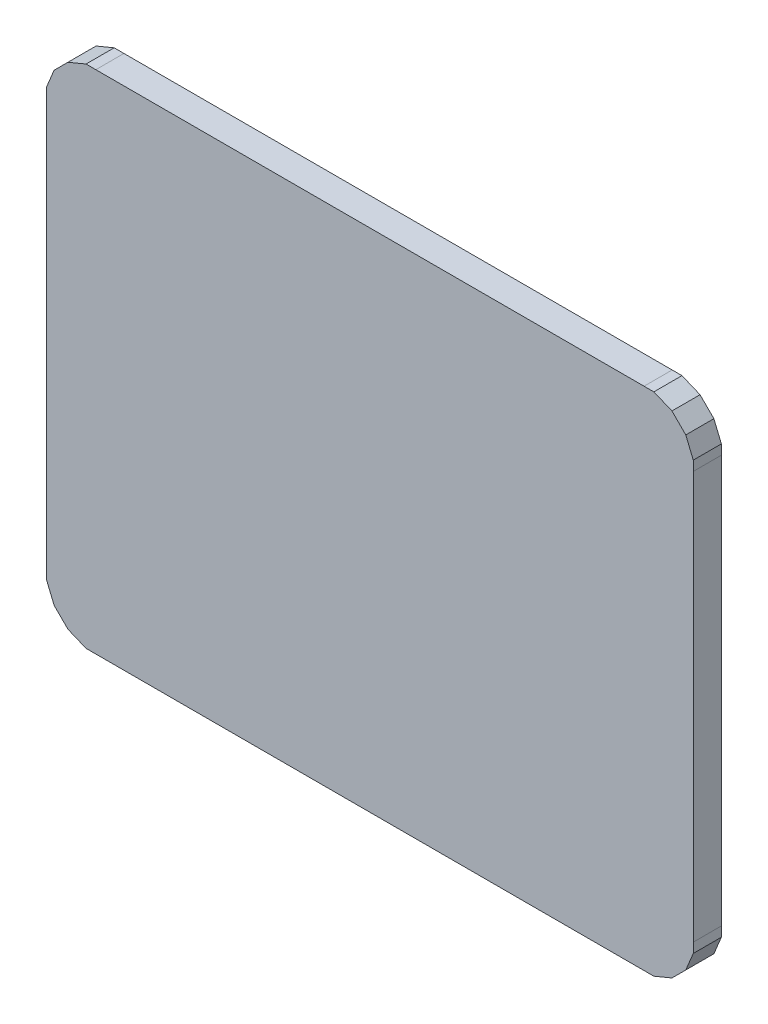
ISO-10303-21;
HEADER;
FILE_DESCRIPTION(('STEP AP214'),'2;1');
FILE_NAME('part.step','',(''),(''),'','','');
FILE_SCHEMA(('AUTOMOTIVE_DESIGN { 1 0 10303 214 1 1 1 1 }'));
ENDSEC;
DATA;
#1=APPLICATION_CONTEXT('core data for automotive mechanical design processes');
#2=APPLICATION_PROTOCOL_DEFINITION('international standard','automotive_design',2000,#1);
#3=PRODUCT_CONTEXT('',#1,'mechanical');
#4=PRODUCT('Part','Part','',(#3));
#5=PRODUCT_RELATED_PRODUCT_CATEGORY('part','',(#4));
#6=PRODUCT_DEFINITION_FORMATION('','',#4);
#7=PRODUCT_DEFINITION_CONTEXT('part definition',#1,'design');
#8=PRODUCT_DEFINITION('design','',#6,#7);
#9=PRODUCT_DEFINITION_SHAPE('','',#8);
#10=(LENGTH_UNIT() NAMED_UNIT(*) SI_UNIT(.MILLI.,.METRE.));
#11=(NAMED_UNIT(*) PLANE_ANGLE_UNIT() SI_UNIT($,.RADIAN.));
#12=(NAMED_UNIT(*) SI_UNIT($,.STERADIAN.) SOLID_ANGLE_UNIT());
#13=UNCERTAINTY_MEASURE_WITH_UNIT(LENGTH_MEASURE(1.E-05),#10,'distance_accuracy_value','');
#14=(GEOMETRIC_REPRESENTATION_CONTEXT(3) GLOBAL_UNCERTAINTY_ASSIGNED_CONTEXT((#13)) GLOBAL_UNIT_ASSIGNED_CONTEXT((#10,
#11,#12)) REPRESENTATION_CONTEXT('',''));
#15=CARTESIAN_POINT('',(0.,0.,0.));
#16=DIRECTION('',(0.,0.,1.));
#17=DIRECTION('',(1.,0.,0.));
#18=AXIS2_PLACEMENT_3D('',#15,#16,#17);
#19=CARTESIAN_POINT('',(-0.97499932,0.90000074,0.0999998));
#20=DIRECTION('',(0.,0.,-1.));
#21=DIRECTION('',(0.,-1.,0.));
#22=AXIS2_PLACEMENT_3D('',#19,#20,#21);
#23=PLANE('',#22);
#24=DIRECTION('',(-1.,0.,0.));
#25=VECTOR('',#24,1.);
#26=CARTESIAN_POINT('',(-0.97499932,0.90000074,0.0999998));
#27=LINE('',#26,#25);
#28=CARTESIAN_POINT('',(-0.97499932,0.90000074,0.0999998));
#29=VERTEX_POINT('',#28);
#30=CARTESIAN_POINT('',(-1.00981002,0.90000074,0.0999998));
#31=VERTEX_POINT('',#30);
#32=EDGE_CURVE('E242',#29,#31,#27,.T.);
#33=ORIENTED_EDGE('',*,*,#32,.T.);
#34=DIRECTION('',(-0.923868310657664,-0.382710523192861,0.));
#35=VECTOR('',#34,1.);
#36=CARTESIAN_POINT('',(-1.00981002,0.90000074,0.0999998));
#37=LINE('',#36,#35);
#38=CARTESIAN_POINT('',(-1.07413044,0.87335614,0.0999998));
#39=VERTEX_POINT('',#38);
#40=EDGE_CURVE('E284',#31,#39,#37,.T.);
#41=ORIENTED_EDGE('',*,*,#40,.T.);
#42=DIRECTION('',(-0.707106781186548,-0.707106781186548,0.));
#43=VECTOR('',#42,1.);
#44=CARTESIAN_POINT('',(-1.07413044,0.87335614,0.0999998));
#45=LINE('',#44,#43);
#46=CARTESIAN_POINT('',(-1.12335818,0.8241284,0.0999998));
#47=VERTEX_POINT('',#46);
#48=EDGE_CURVE('E303',#39,#47,#45,.T.);
#49=ORIENTED_EDGE('',*,*,#48,.T.);
#50=DIRECTION('',(-0.382679382796116,-0.92388120988728,0.));
#51=VECTOR('',#50,1.);
#52=CARTESIAN_POINT('',(-1.12335818,0.8241284,0.0999998));
#53=LINE('',#52,#51);
#54=CARTESIAN_POINT('',(-1.15000024,0.75980798,0.0999998));
#55=VERTEX_POINT('',#54);
#56=EDGE_CURVE('E270',#47,#55,#53,.T.);
#57=ORIENTED_EDGE('',*,*,#56,.T.);
#58=DIRECTION('',(0.,-1.,0.));
#59=VECTOR('',#58,1.);
#60=CARTESIAN_POINT('',(-1.15000024,0.75980798,0.0999998));
#61=LINE('',#60,#59);
#62=CARTESIAN_POINT('',(-1.15000024,0.72499982,0.0999998));
#63=VERTEX_POINT('',#62);
#64=EDGE_CURVE('E336',#55,#63,#61,.T.);
#65=ORIENTED_EDGE('',*,*,#64,.T.);
#66=DIRECTION('',(0.,-1.,0.));
#67=VECTOR('',#66,1.);
#68=CARTESIAN_POINT('',(-1.15000024,0.72499982,0.0999998));
#69=LINE('',#68,#67);
#70=CARTESIAN_POINT('',(-1.15000024,-0.72499982,0.0999998));
#71=VERTEX_POINT('',#70);
#72=EDGE_CURVE('E383',#63,#71,#69,.T.);
#73=ORIENTED_EDGE('',*,*,#72,.T.);
#74=DIRECTION('',(0.,-1.,0.));
#75=VECTOR('',#74,1.);
#76=CARTESIAN_POINT('',(-1.15000024,-0.72499982,0.0999998));
#77=LINE('',#76,#75);
#78=CARTESIAN_POINT('',(-1.15000024,-0.75981052,0.0999998));
#79=VERTEX_POINT('',#78);
#80=EDGE_CURVE('E405',#71,#79,#77,.T.);
#81=ORIENTED_EDGE('',*,*,#80,.T.);
#82=DIRECTION('',(0.382679382796116,-0.92388120988728,0.));
#83=VECTOR('',#82,1.);
#84=CARTESIAN_POINT('',(-1.15000024,-0.75981052,0.0999998));
#85=LINE('',#84,#83);
#86=CARTESIAN_POINT('',(-1.12335818,-0.82413094,0.0999998));
#87=VERTEX_POINT('',#86);
#88=EDGE_CURVE('E271',#79,#87,#85,.T.);
#89=ORIENTED_EDGE('',*,*,#88,.T.);
#90=DIRECTION('',(0.707106781186548,-0.707106781186548,0.));
#91=VECTOR('',#90,1.);
#92=CARTESIAN_POINT('',(-1.12335818,-0.82413094,0.0999998));
#93=LINE('',#92,#91);
#94=CARTESIAN_POINT('',(-1.07413044,-0.87335868,0.0999998));
#95=VERTEX_POINT('',#94);
#96=EDGE_CURVE('E352',#87,#95,#93,.T.);
#97=ORIENTED_EDGE('',*,*,#96,.T.);
#98=DIRECTION('',(0.92388120988728,-0.382679382796116,0.));
#99=VECTOR('',#98,1.);
#100=CARTESIAN_POINT('',(-1.07413044,-0.87335868,0.0999998));
#101=LINE('',#100,#99);
#102=CARTESIAN_POINT('',(-1.00981002,-0.90000074,0.0999998));
#103=VERTEX_POINT('',#102);
#104=EDGE_CURVE('E430',#95,#103,#101,.T.);
#105=ORIENTED_EDGE('',*,*,#104,.T.);
#106=DIRECTION('',(1.,0.,0.));
#107=VECTOR('',#106,1.);
#108=CARTESIAN_POINT('',(-1.00981002,-0.90000074,0.0999998));
#109=LINE('',#108,#107);
#110=CARTESIAN_POINT('',(-0.97499932,-0.90000074,0.0999998));
#111=VERTEX_POINT('',#110);
#112=EDGE_CURVE('E370',#103,#111,#109,.T.);
#113=ORIENTED_EDGE('',*,*,#112,.T.);
#114=DIRECTION('',(1.,0.,0.));
#115=VECTOR('',#114,1.);
#116=CARTESIAN_POINT('',(-0.97499932,-0.90000074,0.0999998));
#117=LINE('',#116,#115);
#118=CARTESIAN_POINT('',(0.97499932,-0.90000074,0.0999998));
#119=VERTEX_POINT('',#118);
#120=EDGE_CURVE('E435',#111,#119,#117,.T.);
#121=ORIENTED_EDGE('',*,*,#120,.T.);
#122=DIRECTION('',(1.,0.,0.));
#123=VECTOR('',#122,1.);
#124=CARTESIAN_POINT('',(0.97499932,-0.90000074,0.0999998));
#125=LINE('',#124,#123);
#126=CARTESIAN_POINT('',(1.00980748,-0.90000074,0.0999998));
#127=VERTEX_POINT('',#126);
#128=EDGE_CURVE('E297',#119,#127,#125,.T.);
#129=ORIENTED_EDGE('',*,*,#128,.T.);
#130=DIRECTION('',(0.92388120988728,0.382679382796116,0.));
#131=VECTOR('',#130,1.);
#132=CARTESIAN_POINT('',(1.00980748,-0.90000074,0.0999998));
#133=LINE('',#132,#131);
#134=CARTESIAN_POINT('',(1.0741279,-0.87335868,0.0999998));
#135=VERTEX_POINT('',#134);
#136=EDGE_CURVE('E464',#127,#135,#133,.T.);
#137=ORIENTED_EDGE('',*,*,#136,.T.);
#138=DIRECTION('',(0.707106781186548,0.707106781186548,0.));
#139=VECTOR('',#138,1.);
#140=CARTESIAN_POINT('',(1.0741279,-0.87335868,0.0999998));
#141=LINE('',#140,#139);
#142=CARTESIAN_POINT('',(1.12335564,-0.82413094,0.0999998));
#143=VERTEX_POINT('',#142);
#144=EDGE_CURVE('E479',#135,#143,#141,.T.);
#145=ORIENTED_EDGE('',*,*,#144,.T.);
#146=DIRECTION('',(0.382710523192008,0.923868310658018,0.));
#147=VECTOR('',#146,1.);
#148=CARTESIAN_POINT('',(1.12335564,-0.82413094,0.0999998));
#149=LINE('',#148,#147);
#150=CARTESIAN_POINT('',(1.15000024,-0.75981052,0.0999998));
#151=VERTEX_POINT('',#150);
#152=EDGE_CURVE('E322',#143,#151,#149,.T.);
#153=ORIENTED_EDGE('',*,*,#152,.T.);
#154=DIRECTION('',(0.,1.,0.));
#155=VECTOR('',#154,1.);
#156=CARTESIAN_POINT('',(1.15000024,-0.75981052,0.0999998));
#157=LINE('',#156,#155);
#158=CARTESIAN_POINT('',(1.15000024,-0.72499982,0.0999998));
#159=VERTEX_POINT('',#158);
#160=EDGE_CURVE('E364',#151,#159,#157,.T.);
#161=ORIENTED_EDGE('',*,*,#160,.T.);
#162=DIRECTION('',(0.,1.,0.));
#163=VECTOR('',#162,1.);
#164=CARTESIAN_POINT('',(1.15000024,-0.72499982,0.0999998));
#165=LINE('',#164,#163);
#166=CARTESIAN_POINT('',(1.15000024,0.72499982,0.0999998));
#167=VERTEX_POINT('',#166);
#168=EDGE_CURVE('E389',#159,#167,#165,.T.);
#169=ORIENTED_EDGE('',*,*,#168,.T.);
#170=DIRECTION('',(0.,1.,0.));
#171=VECTOR('',#170,1.);
#172=CARTESIAN_POINT('',(1.15000024,0.72499982,0.0999998));
#173=LINE('',#172,#171);
#174=CARTESIAN_POINT('',(1.15000024,0.75980798,0.0999998));
#175=VERTEX_POINT('',#174);
#176=EDGE_CURVE('E332',#167,#175,#173,.T.);
#177=ORIENTED_EDGE('',*,*,#176,.T.);
#178=DIRECTION('',(-0.382710523191154,0.923868310658371,0.));
#179=VECTOR('',#178,1.);
#180=CARTESIAN_POINT('',(1.15000024,0.75980798,0.0999998));
#181=LINE('',#180,#179);
#182=CARTESIAN_POINT('',(1.12335564,0.8241284,0.0999998));
#183=VERTEX_POINT('',#182);
#184=EDGE_CURVE('E340',#175,#183,#181,.T.);
#185=ORIENTED_EDGE('',*,*,#184,.T.);
#186=DIRECTION('',(-0.707106781186548,0.707106781186548,0.));
#187=VECTOR('',#186,1.);
#188=CARTESIAN_POINT('',(1.12335564,0.8241284,0.0999998));
#189=LINE('',#188,#187);
#190=CARTESIAN_POINT('',(1.0741279,0.87335614,0.0999998));
#191=VERTEX_POINT('',#190);
#192=EDGE_CURVE('E259',#183,#191,#189,.T.);
#193=ORIENTED_EDGE('',*,*,#192,.T.);
#194=DIRECTION('',(-0.923868310657664,0.382710523192861,0.));
#195=VECTOR('',#194,1.);
#196=CARTESIAN_POINT('',(1.0741279,0.87335614,0.0999998));
#197=LINE('',#196,#195);
#198=CARTESIAN_POINT('',(1.00980748,0.90000074,0.0999998));
#199=VERTEX_POINT('',#198);
#200=EDGE_CURVE('E288',#191,#199,#197,.T.);
#201=ORIENTED_EDGE('',*,*,#200,.T.);
#202=DIRECTION('',(-1.,0.,0.));
#203=VECTOR('',#202,1.);
#204=CARTESIAN_POINT('',(1.00980748,0.90000074,0.0999998));
#205=LINE('',#204,#203);
#206=CARTESIAN_POINT('',(0.97499932,0.90000074,0.0999998));
#207=VERTEX_POINT('',#206);
#208=EDGE_CURVE('E235',#199,#207,#205,.T.);
#209=ORIENTED_EDGE('',*,*,#208,.T.);
#210=DIRECTION('',(-1.,0.,0.));
#211=VECTOR('',#210,1.);
#212=CARTESIAN_POINT('',(0.97499932,0.90000074,0.0999998));
#213=LINE('',#212,#211);
#214=EDGE_CURVE('E11',#207,#29,#213,.T.);
#215=ORIENTED_EDGE('',*,*,#214,.T.);
#216=EDGE_LOOP('',(#33,#41,#49,#57,#65,#73,#81,#89,#97,#105,#113,#121,#129,#137,#145,#153,#161,
#169,#177,#185,#193,#201,#209,#215));
#217=FACE_BOUND('',#216,.T.);
#218=ADVANCED_FACE('F17',(#217),#23,.F.);
#219=CARTESIAN_POINT('',(-0.97499932,0.90000074,0.));
#220=DIRECTION('',(0.,0.,-1.));
#221=DIRECTION('',(0.,-1.,0.));
#222=AXIS2_PLACEMENT_3D('',#219,#220,#221);
#223=PLANE('',#222);
#224=DIRECTION('',(-1.,0.,0.));
#225=VECTOR('',#224,1.);
#226=CARTESIAN_POINT('',(0.97499932,0.90000074,0.));
#227=LINE('',#226,#225);
#228=CARTESIAN_POINT('',(0.97499932,0.90000074,0.));
#229=VERTEX_POINT('',#228);
#230=CARTESIAN_POINT('',(-0.97499932,0.90000074,0.));
#231=VERTEX_POINT('',#230);
#232=EDGE_CURVE('E26',#229,#231,#227,.T.);
#233=ORIENTED_EDGE('',*,*,#232,.F.);
#234=DIRECTION('',(-1.,0.,0.));
#235=VECTOR('',#234,1.);
#236=CARTESIAN_POINT('',(1.00980748,0.90000074,0.));
#237=LINE('',#236,#235);
#238=CARTESIAN_POINT('',(1.00980748,0.90000074,0.));
#239=VERTEX_POINT('',#238);
#240=EDGE_CURVE('E292',#239,#229,#237,.T.);
#241=ORIENTED_EDGE('',*,*,#240,.F.);
#242=DIRECTION('',(-0.923868310657664,0.382710523192861,0.));
#243=VECTOR('',#242,1.);
#244=CARTESIAN_POINT('',(1.0741279,0.87335614,0.));
#245=LINE('',#244,#243);
#246=CARTESIAN_POINT('',(1.0741279,0.87335614,0.));
#247=VERTEX_POINT('',#246);
#248=EDGE_CURVE('E262',#247,#239,#245,.T.);
#249=ORIENTED_EDGE('',*,*,#248,.F.);
#250=DIRECTION('',(-0.707106781186548,0.707106781186548,0.));
#251=VECTOR('',#250,1.);
#252=CARTESIAN_POINT('',(1.12335564,0.8241284,0.));
#253=LINE('',#252,#251);
#254=CARTESIAN_POINT('',(1.12335564,0.8241284,0.));
#255=VERTEX_POINT('',#254);
#256=EDGE_CURVE('E397',#255,#247,#253,.T.);
#257=ORIENTED_EDGE('',*,*,#256,.F.);
#258=DIRECTION('',(-0.382710523191154,0.923868310658371,0.));
#259=VECTOR('',#258,1.);
#260=CARTESIAN_POINT('',(1.15000024,0.75980798,0.));
#261=LINE('',#260,#259);
#262=CARTESIAN_POINT('',(1.15000024,0.75980798,0.));
#263=VERTEX_POINT('',#262);
#264=EDGE_CURVE('E327',#263,#255,#261,.T.);
#265=ORIENTED_EDGE('',*,*,#264,.F.);
#266=DIRECTION('',(0.,1.,0.));
#267=VECTOR('',#266,1.);
#268=CARTESIAN_POINT('',(1.15000024,0.72499982,0.));
#269=LINE('',#268,#267);
#270=CARTESIAN_POINT('',(1.15000024,0.72499982,0.));
#271=VERTEX_POINT('',#270);
#272=EDGE_CURVE('E384',#271,#263,#269,.T.);
#273=ORIENTED_EDGE('',*,*,#272,.F.);
#274=DIRECTION('',(0.,1.,0.));
#275=VECTOR('',#274,1.);
#276=CARTESIAN_POINT('',(1.15000024,-0.72499982,0.));
#277=LINE('',#276,#275);
#278=CARTESIAN_POINT('',(1.15000024,-0.72499982,0.));
#279=VERTEX_POINT('',#278);
#280=EDGE_CURVE('E425',#279,#271,#277,.T.);
#281=ORIENTED_EDGE('',*,*,#280,.F.);
#282=DIRECTION('',(0.,1.,0.));
#283=VECTOR('',#282,1.);
#284=CARTESIAN_POINT('',(1.15000024,-0.75981052,0.));
#285=LINE('',#284,#283);
#286=CARTESIAN_POINT('',(1.15000024,-0.75981052,0.));
#287=VERTEX_POINT('',#286);
#288=EDGE_CURVE('E365',#287,#279,#285,.T.);
#289=ORIENTED_EDGE('',*,*,#288,.F.);
#290=DIRECTION('',(0.382710523192008,0.923868310658018,0.));
#291=VECTOR('',#290,1.);
#292=CARTESIAN_POINT('',(1.12335564,-0.82413094,0.));
#293=LINE('',#292,#291);
#294=CARTESIAN_POINT('',(1.12335564,-0.82413094,0.));
#295=VERTEX_POINT('',#294);
#296=EDGE_CURVE('E323',#295,#287,#293,.T.);
#297=ORIENTED_EDGE('',*,*,#296,.F.);
#298=DIRECTION('',(0.707106781186548,0.707106781186548,0.));
#299=VECTOR('',#298,1.);
#300=CARTESIAN_POINT('',(1.0741279,-0.87335868,0.));
#301=LINE('',#300,#299);
#302=CARTESIAN_POINT('',(1.0741279,-0.87335868,0.));
#303=VERTEX_POINT('',#302);
#304=EDGE_CURVE('E471',#303,#295,#301,.T.);
#305=ORIENTED_EDGE('',*,*,#304,.F.);
#306=DIRECTION('',(0.92388120988728,0.382679382796116,0.));
#307=VECTOR('',#306,1.);
#308=CARTESIAN_POINT('',(1.00980748,-0.90000074,0.));
#309=LINE('',#308,#307);
#310=CARTESIAN_POINT('',(1.00980748,-0.90000074,0.));
#311=VERTEX_POINT('',#310);
#312=EDGE_CURVE('E301',#311,#303,#309,.T.);
#313=ORIENTED_EDGE('',*,*,#312,.F.);
#314=DIRECTION('',(1.,0.,0.));
#315=VECTOR('',#314,1.);
#316=CARTESIAN_POINT('',(0.97499932,-0.90000074,0.));
#317=LINE('',#316,#315);
#318=CARTESIAN_POINT('',(0.97499932,-0.90000074,0.));
#319=VERTEX_POINT('',#318);
#320=EDGE_CURVE('E431',#319,#311,#317,.T.);
#321=ORIENTED_EDGE('',*,*,#320,.F.);
#322=DIRECTION('',(1.,0.,0.));
#323=VECTOR('',#322,1.);
#324=CARTESIAN_POINT('',(-0.97499932,-0.90000074,0.));
#325=LINE('',#324,#323);
#326=CARTESIAN_POINT('',(-0.97499932,-0.90000074,0.));
#327=VERTEX_POINT('',#326);
#328=EDGE_CURVE('E374',#327,#319,#325,.T.);
#329=ORIENTED_EDGE('',*,*,#328,.F.);
#330=DIRECTION('',(1.,0.,0.));
#331=VECTOR('',#330,1.);
#332=CARTESIAN_POINT('',(-1.00981002,-0.90000074,0.));
#333=LINE('',#332,#331);
#334=CARTESIAN_POINT('',(-1.00981002,-0.90000074,0.));
#335=VERTEX_POINT('',#334);
#336=EDGE_CURVE('E439',#335,#327,#333,.T.);
#337=ORIENTED_EDGE('',*,*,#336,.F.);
#338=DIRECTION('',(0.92388120988728,-0.382679382796116,0.));
#339=VECTOR('',#338,1.);
#340=CARTESIAN_POINT('',(-1.07413044,-0.87335868,0.));
#341=LINE('',#340,#339);
#342=CARTESIAN_POINT('',(-1.07413044,-0.87335868,0.));
#343=VERTEX_POINT('',#342);
#344=EDGE_CURVE('E258',#343,#335,#341,.T.);
#345=ORIENTED_EDGE('',*,*,#344,.F.);
#346=DIRECTION('',(0.707106781186548,-0.707106781186548,0.));
#347=VECTOR('',#346,1.);
#348=CARTESIAN_POINT('',(-1.12335818,-0.82413094,0.));
#349=LINE('',#348,#347);
#350=CARTESIAN_POINT('',(-1.12335818,-0.82413094,0.));
#351=VERTEX_POINT('',#350);
#352=EDGE_CURVE('E275',#351,#343,#349,.T.);
#353=ORIENTED_EDGE('',*,*,#352,.F.);
#354=DIRECTION('',(0.382679382796116,-0.92388120988728,0.));
#355=VECTOR('',#354,1.);
#356=CARTESIAN_POINT('',(-1.15000024,-0.75981052,0.));
#357=LINE('',#356,#355);
#358=CARTESIAN_POINT('',(-1.15000024,-0.75981052,0.));
#359=VERTEX_POINT('',#358);
#360=EDGE_CURVE('E314',#359,#351,#357,.T.);
#361=ORIENTED_EDGE('',*,*,#360,.F.);
#362=DIRECTION('',(0.,-1.,0.));
#363=VECTOR('',#362,1.);
#364=CARTESIAN_POINT('',(-1.15000024,-0.72499982,0.));
#365=LINE('',#364,#363);
#366=CARTESIAN_POINT('',(-1.15000024,-0.72499982,0.));
#367=VERTEX_POINT('',#366);
#368=EDGE_CURVE('E393',#367,#359,#365,.T.);
#369=ORIENTED_EDGE('',*,*,#368,.F.);
#370=DIRECTION('',(0.,-1.,0.));
#371=VECTOR('',#370,1.);
#372=CARTESIAN_POINT('',(-1.15000024,0.72499982,0.));
#373=LINE('',#372,#371);
#374=CARTESIAN_POINT('',(-1.15000024,0.72499982,0.));
#375=VERTEX_POINT('',#374);
#376=EDGE_CURVE('E359',#375,#367,#373,.T.);
#377=ORIENTED_EDGE('',*,*,#376,.F.);
#378=DIRECTION('',(0.,-1.,0.));
#379=VECTOR('',#378,1.);
#380=CARTESIAN_POINT('',(-1.15000024,0.75980798,0.));
#381=LINE('',#380,#379);
#382=CARTESIAN_POINT('',(-1.15000024,0.75980798,0.));
#383=VERTEX_POINT('',#382);
#384=EDGE_CURVE('E265',#383,#375,#381,.T.);
#385=ORIENTED_EDGE('',*,*,#384,.F.);
#386=DIRECTION('',(-0.382679382796116,-0.92388120988728,0.));
#387=VECTOR('',#386,1.);
#388=CARTESIAN_POINT('',(-1.12335818,0.8241284,0.));
#389=LINE('',#388,#387);
#390=CARTESIAN_POINT('',(-1.12335818,0.8241284,0.));
#391=VERTEX_POINT('',#390);
#392=EDGE_CURVE('E307',#391,#383,#389,.T.);
#393=ORIENTED_EDGE('',*,*,#392,.F.);
#394=DIRECTION('',(-0.707106781186548,-0.707106781186548,0.));
#395=VECTOR('',#394,1.);
#396=CARTESIAN_POINT('',(-1.07413044,0.87335614,0.));
#397=LINE('',#396,#395);
#398=CARTESIAN_POINT('',(-1.07413044,0.87335614,0.));
#399=VERTEX_POINT('',#398);
#400=EDGE_CURVE('E279',#399,#391,#397,.T.);
#401=ORIENTED_EDGE('',*,*,#400,.F.);
#402=DIRECTION('',(-0.923868310657664,-0.382710523192861,0.));
#403=VECTOR('',#402,1.);
#404=CARTESIAN_POINT('',(-1.00981002,0.90000074,0.));
#405=LINE('',#404,#403);
#406=CARTESIAN_POINT('',(-1.00981002,0.90000074,0.));
#407=VERTEX_POINT('',#406);
#408=EDGE_CURVE('E244',#407,#399,#405,.T.);
#409=ORIENTED_EDGE('',*,*,#408,.F.);
#410=DIRECTION('',(-1.,0.,0.));
#411=VECTOR('',#410,1.);
#412=CARTESIAN_POINT('',(-0.97499932,0.90000074,0.));
#413=LINE('',#412,#411);
#414=EDGE_CURVE('E240',#231,#407,#413,.T.);
#415=ORIENTED_EDGE('',*,*,#414,.F.);
#416=EDGE_LOOP('',(#233,#241,#249,#257,#265,#273,#281,#289,#297,#305,#313,#321,#329,#337,#345,
#353,#361,#369,#377,#385,#393,#401,#409,#415));
#417=FACE_BOUND('',#416,.T.);
#418=ADVANCED_FACE('F19',(#417),#223,.T.);
#419=CARTESIAN_POINT('',(0.97499932,0.90000074,0.));
#420=DIRECTION('',(0.,-1.,0.));
#421=DIRECTION('',(0.,0.,-1.));
#422=AXIS2_PLACEMENT_3D('',#419,#420,#421);
#423=PLANE('',#422);
#424=ORIENTED_EDGE('',*,*,#232,.T.);
#425=DIRECTION('',(0.,0.,1.));
#426=VECTOR('',#425,1.);
#427=CARTESIAN_POINT('',(-0.97499932,0.90000074,0.));
#428=LINE('',#427,#426);
#429=EDGE_CURVE('E229',#231,#29,#428,.T.);
#430=ORIENTED_EDGE('',*,*,#429,.T.);
#431=ORIENTED_EDGE('',*,*,#214,.F.);
#432=DIRECTION('',(0.,0.,1.));
#433=VECTOR('',#432,1.);
#434=CARTESIAN_POINT('',(0.97499932,0.90000074,0.));
#435=LINE('',#434,#433);
#436=EDGE_CURVE('E232',#229,#207,#435,.T.);
#437=ORIENTED_EDGE('',*,*,#436,.F.);
#438=EDGE_LOOP('',(#424,#430,#431,#437));
#439=FACE_BOUND('',#438,.T.);
#440=ADVANCED_FACE('F228',(#439),#423,.F.);
#441=CARTESIAN_POINT('',(1.00980748,0.90000074,0.));
#442=DIRECTION('',(0.,-1.,0.));
#443=DIRECTION('',(0.,0.,-1.));
#444=AXIS2_PLACEMENT_3D('',#441,#442,#443);
#445=PLANE('',#444);
#446=ORIENTED_EDGE('',*,*,#240,.T.);
#447=ORIENTED_EDGE('',*,*,#436,.T.);
#448=ORIENTED_EDGE('',*,*,#208,.F.);
#449=DIRECTION('',(0.,0.,1.));
#450=VECTOR('',#449,1.);
#451=CARTESIAN_POINT('',(1.00980748,0.90000074,0.));
#452=LINE('',#451,#450);
#453=EDGE_CURVE('E293',#239,#199,#452,.T.);
#454=ORIENTED_EDGE('',*,*,#453,.F.);
#455=EDGE_LOOP('',(#446,#447,#448,#454));
#456=FACE_BOUND('',#455,.T.);
#457=ADVANCED_FACE('F516',(#456),#445,.F.);
#458=CARTESIAN_POINT('',(1.0741279,0.87335614,0.));
#459=DIRECTION('',(-0.382710523192861,-0.923868310657664,0.));
#460=DIRECTION('',(-0.923868310657664,0.382710523192861,0.));
#461=AXIS2_PLACEMENT_3D('',#458,#459,#460);
#462=PLANE('',#461);
#463=ORIENTED_EDGE('',*,*,#248,.T.);
#464=ORIENTED_EDGE('',*,*,#453,.T.);
#465=ORIENTED_EDGE('',*,*,#200,.F.);
#466=DIRECTION('',(0.,0.,1.));
#467=VECTOR('',#466,1.);
#468=CARTESIAN_POINT('',(1.0741279,0.87335614,0.));
#469=LINE('',#468,#467);
#470=EDGE_CURVE('E263',#247,#191,#469,.T.);
#471=ORIENTED_EDGE('',*,*,#470,.F.);
#472=EDGE_LOOP('',(#463,#464,#465,#471));
#473=FACE_BOUND('',#472,.T.);
#474=ADVANCED_FACE('F521',(#473),#462,.F.);
#475=CARTESIAN_POINT('',(1.12335564,0.8241284,0.));
#476=DIRECTION('',(-0.707106781186548,-0.707106781186548,0.));
#477=DIRECTION('',(-0.707106781186548,0.707106781186548,0.));
#478=AXIS2_PLACEMENT_3D('',#475,#476,#477);
#479=PLANE('',#478);
#480=ORIENTED_EDGE('',*,*,#256,.T.);
#481=ORIENTED_EDGE('',*,*,#470,.T.);
#482=ORIENTED_EDGE('',*,*,#192,.F.);
#483=DIRECTION('',(0.,0.,1.));
#484=VECTOR('',#483,1.);
#485=CARTESIAN_POINT('',(1.12335564,0.8241284,0.));
#486=LINE('',#485,#484);
#487=EDGE_CURVE('E331',#255,#183,#486,.T.);
#488=ORIENTED_EDGE('',*,*,#487,.F.);
#489=EDGE_LOOP('',(#480,#481,#482,#488));
#490=FACE_BOUND('',#489,.T.);
#491=ADVANCED_FACE('F523',(#490),#479,.F.);
#492=CARTESIAN_POINT('',(1.15000024,0.75980798,0.));
#493=DIRECTION('',(-0.923868310658371,-0.382710523191154,0.));
#494=DIRECTION('',(-0.382710523191154,0.923868310658371,0.));
#495=AXIS2_PLACEMENT_3D('',#492,#493,#494);
#496=PLANE('',#495);
#497=ORIENTED_EDGE('',*,*,#264,.T.);
#498=ORIENTED_EDGE('',*,*,#487,.T.);
#499=ORIENTED_EDGE('',*,*,#184,.F.);
#500=DIRECTION('',(0.,0.,1.));
#501=VECTOR('',#500,1.);
#502=CARTESIAN_POINT('',(1.15000024,0.75980798,0.));
#503=LINE('',#502,#501);
#504=EDGE_CURVE('E388',#263,#175,#503,.T.);
#505=ORIENTED_EDGE('',*,*,#504,.F.);
#506=EDGE_LOOP('',(#497,#498,#499,#505));
#507=FACE_BOUND('',#506,.T.);
#508=ADVANCED_FACE('F526',(#507),#496,.F.);
#509=CARTESIAN_POINT('',(1.15000024,0.72499982,0.));
#510=DIRECTION('',(-1.,0.,0.));
#511=DIRECTION('',(0.,0.,1.));
#512=AXIS2_PLACEMENT_3D('',#509,#510,#511);
#513=PLANE('',#512);
#514=ORIENTED_EDGE('',*,*,#272,.T.);
#515=ORIENTED_EDGE('',*,*,#504,.T.);
#516=ORIENTED_EDGE('',*,*,#176,.F.);
#517=DIRECTION('',(0.,0.,1.));
#518=VECTOR('',#517,1.);
#519=CARTESIAN_POINT('',(1.15000024,0.72499982,0.));
#520=LINE('',#519,#518);
#521=EDGE_CURVE('E421',#271,#167,#520,.T.);
#522=ORIENTED_EDGE('',*,*,#521,.F.);
#523=EDGE_LOOP('',(#514,#515,#516,#522));
#524=FACE_BOUND('',#523,.T.);
#525=ADVANCED_FACE('F530',(#524),#513,.F.);
#526=CARTESIAN_POINT('',(1.15000024,-0.72499982,0.));
#527=DIRECTION('',(-1.,0.,0.));
#528=DIRECTION('',(0.,0.,1.));
#529=AXIS2_PLACEMENT_3D('',#526,#527,#528);
#530=PLANE('',#529);
#531=ORIENTED_EDGE('',*,*,#280,.T.);
#532=ORIENTED_EDGE('',*,*,#521,.T.);
#533=ORIENTED_EDGE('',*,*,#168,.F.);
#534=DIRECTION('',(0.,0.,1.));
#535=VECTOR('',#534,1.);
#536=CARTESIAN_POINT('',(1.15000024,-0.72499982,0.));
#537=LINE('',#536,#535);
#538=EDGE_CURVE('E360',#279,#159,#537,.T.);
#539=ORIENTED_EDGE('',*,*,#538,.F.);
#540=EDGE_LOOP('',(#531,#532,#533,#539));
#541=FACE_BOUND('',#540,.T.);
#542=ADVANCED_FACE('F532',(#541),#530,.F.);
#543=CARTESIAN_POINT('',(1.15000024,-0.75981052,0.));
#544=DIRECTION('',(-1.,0.,0.));
#545=DIRECTION('',(0.,0.,1.));
#546=AXIS2_PLACEMENT_3D('',#543,#544,#545);
#547=PLANE('',#546);
#548=ORIENTED_EDGE('',*,*,#288,.T.);
#549=ORIENTED_EDGE('',*,*,#538,.T.);
#550=ORIENTED_EDGE('',*,*,#160,.F.);
#551=DIRECTION('',(0.,0.,1.));
#552=VECTOR('',#551,1.);
#553=CARTESIAN_POINT('',(1.15000024,-0.75981052,0.));
#554=LINE('',#553,#552);
#555=EDGE_CURVE('E318',#287,#151,#554,.T.);
#556=ORIENTED_EDGE('',*,*,#555,.F.);
#557=EDGE_LOOP('',(#548,#549,#550,#556));
#558=FACE_BOUND('',#557,.T.);
#559=ADVANCED_FACE('F535',(#558),#547,.F.);
#560=CARTESIAN_POINT('',(1.12335564,-0.82413094,0.));
#561=DIRECTION('',(-0.923868310658018,0.382710523192008,0.));
#562=DIRECTION('',(0.,0.,1.));
#563=AXIS2_PLACEMENT_3D('',#560,#561,#562);
#564=PLANE('',#563);
#565=ORIENTED_EDGE('',*,*,#296,.T.);
#566=ORIENTED_EDGE('',*,*,#555,.T.);
#567=ORIENTED_EDGE('',*,*,#152,.F.);
#568=DIRECTION('',(0.,0.,1.));
#569=VECTOR('',#568,1.);
#570=CARTESIAN_POINT('',(1.12335564,-0.82413094,0.));
#571=LINE('',#570,#569);
#572=EDGE_CURVE('E475',#295,#143,#571,.T.);
#573=ORIENTED_EDGE('',*,*,#572,.F.);
#574=EDGE_LOOP('',(#565,#566,#567,#573));
#575=FACE_BOUND('',#574,.T.);
#576=ADVANCED_FACE('F539',(#575),#564,.F.);
#577=CARTESIAN_POINT('',(1.0741279,-0.87335868,0.));
#578=DIRECTION('',(-0.707106781186548,0.707106781186548,0.));
#579=DIRECTION('',(0.,0.,1.));
#580=AXIS2_PLACEMENT_3D('',#577,#578,#579);
#581=PLANE('',#580);
#582=ORIENTED_EDGE('',*,*,#304,.T.);
#583=ORIENTED_EDGE('',*,*,#572,.T.);
#584=ORIENTED_EDGE('',*,*,#144,.F.);
#585=DIRECTION('',(0.,0.,1.));
#586=VECTOR('',#585,1.);
#587=CARTESIAN_POINT('',(1.0741279,-0.87335868,0.));
#588=LINE('',#587,#586);
#589=EDGE_CURVE('E369',#303,#135,#588,.T.);
#590=ORIENTED_EDGE('',*,*,#589,.F.);
#591=EDGE_LOOP('',(#582,#583,#584,#590));
#592=FACE_BOUND('',#591,.T.);
#593=ADVANCED_FACE('F541',(#592),#581,.F.);
#594=CARTESIAN_POINT('',(1.00980748,-0.90000074,0.));
#595=DIRECTION('',(-0.382679382796116,0.92388120988728,0.));
#596=DIRECTION('',(0.,0.,1.));
#597=AXIS2_PLACEMENT_3D('',#594,#595,#596);
#598=PLANE('',#597);
#599=ORIENTED_EDGE('',*,*,#312,.T.);
#600=ORIENTED_EDGE('',*,*,#589,.T.);
#601=ORIENTED_EDGE('',*,*,#136,.F.);
#602=DIRECTION('',(0.,0.,1.));
#603=VECTOR('',#602,1.);
#604=CARTESIAN_POINT('',(1.00980748,-0.90000074,0.));
#605=LINE('',#604,#603);
#606=EDGE_CURVE('E302',#311,#127,#605,.T.);
#607=ORIENTED_EDGE('',*,*,#606,.F.);
#608=EDGE_LOOP('',(#599,#600,#601,#607));
#609=FACE_BOUND('',#608,.T.);
#610=ADVANCED_FACE('F544',(#609),#598,.F.);
#611=CARTESIAN_POINT('',(0.97499932,-0.90000074,0.));
#612=DIRECTION('',(0.,1.,0.));
#613=DIRECTION('',(1.,0.,0.));
#614=AXIS2_PLACEMENT_3D('',#611,#612,#613);
#615=PLANE('',#614);
#616=ORIENTED_EDGE('',*,*,#320,.T.);
#617=ORIENTED_EDGE('',*,*,#606,.T.);
#618=ORIENTED_EDGE('',*,*,#128,.F.);
#619=DIRECTION('',(0.,0.,1.));
#620=VECTOR('',#619,1.);
#621=CARTESIAN_POINT('',(0.97499932,-0.90000074,0.));
#622=LINE('',#621,#620);
#623=EDGE_CURVE('E451',#319,#119,#622,.T.);
#624=ORIENTED_EDGE('',*,*,#623,.F.);
#625=EDGE_LOOP('',(#616,#617,#618,#624));
#626=FACE_BOUND('',#625,.T.);
#627=ADVANCED_FACE('F548',(#626),#615,.F.);
#628=CARTESIAN_POINT('',(-0.97499932,-0.90000074,0.));
#629=DIRECTION('',(0.,1.,0.));
#630=DIRECTION('',(1.,0.,0.));
#631=AXIS2_PLACEMENT_3D('',#628,#629,#630);
#632=PLANE('',#631);
#633=ORIENTED_EDGE('',*,*,#328,.T.);
#634=ORIENTED_EDGE('',*,*,#623,.T.);
#635=ORIENTED_EDGE('',*,*,#120,.F.);
#636=DIRECTION('',(0.,0.,1.));
#637=VECTOR('',#636,1.);
#638=CARTESIAN_POINT('',(-0.97499932,-0.90000074,0.));
#639=LINE('',#638,#637);
#640=EDGE_CURVE('E375',#327,#111,#639,.T.);
#641=ORIENTED_EDGE('',*,*,#640,.F.);
#642=EDGE_LOOP('',(#633,#634,#635,#641));
#643=FACE_BOUND('',#642,.T.);
#644=ADVANCED_FACE('F550',(#643),#632,.F.);
#645=CARTESIAN_POINT('',(-1.00981002,-0.90000074,0.));
#646=DIRECTION('',(0.,1.,0.));
#647=DIRECTION('',(1.,0.,0.));
#648=AXIS2_PLACEMENT_3D('',#645,#646,#647);
#649=PLANE('',#648);
#650=ORIENTED_EDGE('',*,*,#336,.T.);
#651=ORIENTED_EDGE('',*,*,#640,.T.);
#652=ORIENTED_EDGE('',*,*,#112,.F.);
#653=DIRECTION('',(0.,0.,1.));
#654=VECTOR('',#653,1.);
#655=CARTESIAN_POINT('',(-1.00981002,-0.90000074,0.));
#656=LINE('',#655,#654);
#657=EDGE_CURVE('E426',#335,#103,#656,.T.);
#658=ORIENTED_EDGE('',*,*,#657,.F.);
#659=EDGE_LOOP('',(#650,#651,#652,#658));
#660=FACE_BOUND('',#659,.T.);
#661=ADVANCED_FACE('F553',(#660),#649,.F.);
#662=CARTESIAN_POINT('',(-1.07413044,-0.87335868,0.));
#663=DIRECTION('',(0.382679382796116,0.92388120988728,0.));
#664=DIRECTION('',(0.,0.,-1.));
#665=AXIS2_PLACEMENT_3D('',#662,#663,#664);
#666=PLANE('',#665);
#667=ORIENTED_EDGE('',*,*,#344,.T.);
#668=ORIENTED_EDGE('',*,*,#657,.T.);
#669=ORIENTED_EDGE('',*,*,#104,.F.);
#670=DIRECTION('',(0.,0.,1.));
#671=VECTOR('',#670,1.);
#672=CARTESIAN_POINT('',(-1.07413044,-0.87335868,0.));
#673=LINE('',#672,#671);
#674=EDGE_CURVE('E348',#343,#95,#673,.T.);
#675=ORIENTED_EDGE('',*,*,#674,.F.);
#676=EDGE_LOOP('',(#667,#668,#669,#675));
#677=FACE_BOUND('',#676,.T.);
#678=ADVANCED_FACE('F559',(#677),#666,.F.);
#679=CARTESIAN_POINT('',(-1.12335818,-0.82413094,0.));
#680=DIRECTION('',(0.707106781186548,0.707106781186548,0.));
#681=DIRECTION('',(0.,0.,-1.));
#682=AXIS2_PLACEMENT_3D('',#679,#680,#681);
#683=PLANE('',#682);
#684=ORIENTED_EDGE('',*,*,#352,.T.);
#685=ORIENTED_EDGE('',*,*,#674,.T.);
#686=ORIENTED_EDGE('',*,*,#96,.F.);
#687=DIRECTION('',(0.,0.,1.));
#688=VECTOR('',#687,1.);
#689=CARTESIAN_POINT('',(-1.12335818,-0.82413094,0.));
#690=LINE('',#689,#688);
#691=EDGE_CURVE('E276',#351,#87,#690,.T.);
#692=ORIENTED_EDGE('',*,*,#691,.F.);
#693=EDGE_LOOP('',(#684,#685,#686,#692));
#694=FACE_BOUND('',#693,.T.);
#695=ADVANCED_FACE('F561',(#694),#683,.F.);
#696=CARTESIAN_POINT('',(-1.15000024,-0.75981052,0.));
#697=DIRECTION('',(0.92388120988728,0.382679382796116,0.));
#698=DIRECTION('',(0.,0.,-1.));
#699=AXIS2_PLACEMENT_3D('',#696,#697,#698);
#700=PLANE('',#699);
#701=ORIENTED_EDGE('',*,*,#360,.T.);
#702=ORIENTED_EDGE('',*,*,#691,.T.);
#703=ORIENTED_EDGE('',*,*,#88,.F.);
#704=DIRECTION('',(0.,0.,1.));
#705=VECTOR('',#704,1.);
#706=CARTESIAN_POINT('',(-1.15000024,-0.75981052,0.));
#707=LINE('',#706,#705);
#708=EDGE_CURVE('E401',#359,#79,#707,.T.);
#709=ORIENTED_EDGE('',*,*,#708,.F.);
#710=EDGE_LOOP('',(#701,#702,#703,#709));
#711=FACE_BOUND('',#710,.T.);
#712=ADVANCED_FACE('F564',(#711),#700,.F.);
#713=CARTESIAN_POINT('',(-1.15000024,-0.72499982,0.));
#714=DIRECTION('',(1.,0.,0.));
#715=DIRECTION('',(0.,1.,0.));
#716=AXIS2_PLACEMENT_3D('',#713,#714,#715);
#717=PLANE('',#716);
#718=ORIENTED_EDGE('',*,*,#368,.T.);
#719=ORIENTED_EDGE('',*,*,#708,.T.);
#720=ORIENTED_EDGE('',*,*,#80,.F.);
#721=DIRECTION('',(0.,0.,1.));
#722=VECTOR('',#721,1.);
#723=CARTESIAN_POINT('',(-1.15000024,-0.72499982,0.));
#724=LINE('',#723,#722);
#725=EDGE_CURVE('E379',#367,#71,#724,.T.);
#726=ORIENTED_EDGE('',*,*,#725,.F.);
#727=EDGE_LOOP('',(#718,#719,#720,#726));
#728=FACE_BOUND('',#727,.T.);
#729=ADVANCED_FACE('F568',(#728),#717,.F.);
#730=CARTESIAN_POINT('',(-1.15000024,0.72499982,0.));
#731=DIRECTION('',(1.,0.,0.));
#732=DIRECTION('',(0.,1.,0.));
#733=AXIS2_PLACEMENT_3D('',#730,#731,#732);
#734=PLANE('',#733);
#735=ORIENTED_EDGE('',*,*,#376,.T.);
#736=ORIENTED_EDGE('',*,*,#725,.T.);
#737=ORIENTED_EDGE('',*,*,#72,.F.);
#738=DIRECTION('',(0.,0.,1.));
#739=VECTOR('',#738,1.);
#740=CARTESIAN_POINT('',(-1.15000024,0.72499982,0.));
#741=LINE('',#740,#739);
#742=EDGE_CURVE('E269',#375,#63,#741,.T.);
#743=ORIENTED_EDGE('',*,*,#742,.F.);
#744=EDGE_LOOP('',(#735,#736,#737,#743));
#745=FACE_BOUND('',#744,.T.);
#746=ADVANCED_FACE('F570',(#745),#734,.F.);
#747=CARTESIAN_POINT('',(-1.15000024,0.75980798,0.));
#748=DIRECTION('',(1.,0.,0.));
#749=DIRECTION('',(0.,1.,0.));
#750=AXIS2_PLACEMENT_3D('',#747,#748,#749);
#751=PLANE('',#750);
#752=ORIENTED_EDGE('',*,*,#384,.T.);
#753=ORIENTED_EDGE('',*,*,#742,.T.);
#754=ORIENTED_EDGE('',*,*,#64,.F.);
#755=DIRECTION('',(0.,0.,1.));
#756=VECTOR('',#755,1.);
#757=CARTESIAN_POINT('',(-1.15000024,0.75980798,0.));
#758=LINE('',#757,#756);
#759=EDGE_CURVE('E344',#383,#55,#758,.T.);
#760=ORIENTED_EDGE('',*,*,#759,.F.);
#761=EDGE_LOOP('',(#752,#753,#754,#760));
#762=FACE_BOUND('',#761,.T.);
#763=ADVANCED_FACE('F573',(#762),#751,.F.);
#764=CARTESIAN_POINT('',(-1.12335818,0.8241284,0.));
#765=DIRECTION('',(0.92388120988728,-0.382679382796116,0.));
#766=DIRECTION('',(0.,0.,-1.));
#767=AXIS2_PLACEMENT_3D('',#764,#765,#766);
#768=PLANE('',#767);
#769=ORIENTED_EDGE('',*,*,#392,.T.);
#770=ORIENTED_EDGE('',*,*,#759,.T.);
#771=ORIENTED_EDGE('',*,*,#56,.F.);
#772=DIRECTION('',(0.,0.,1.));
#773=VECTOR('',#772,1.);
#774=CARTESIAN_POINT('',(-1.12335818,0.8241284,0.));
#775=LINE('',#774,#773);
#776=EDGE_CURVE('E283',#391,#47,#775,.T.);
#777=ORIENTED_EDGE('',*,*,#776,.F.);
#778=EDGE_LOOP('',(#769,#770,#771,#777));
#779=FACE_BOUND('',#778,.T.);
#780=ADVANCED_FACE('F577',(#779),#768,.F.);
#781=CARTESIAN_POINT('',(-1.07413044,0.87335614,0.));
#782=DIRECTION('',(0.707106781186548,-0.707106781186548,0.));
#783=DIRECTION('',(0.,0.,-1.));
#784=AXIS2_PLACEMENT_3D('',#781,#782,#783);
#785=PLANE('',#784);
#786=ORIENTED_EDGE('',*,*,#400,.T.);
#787=ORIENTED_EDGE('',*,*,#776,.T.);
#788=ORIENTED_EDGE('',*,*,#48,.F.);
#789=DIRECTION('',(0.,0.,1.));
#790=VECTOR('',#789,1.);
#791=CARTESIAN_POINT('',(-1.07413044,0.87335614,0.));
#792=LINE('',#791,#790);
#793=EDGE_CURVE('E287',#399,#39,#792,.T.);
#794=ORIENTED_EDGE('',*,*,#793,.F.);
#795=EDGE_LOOP('',(#786,#787,#788,#794));
#796=FACE_BOUND('',#795,.T.);
#797=ADVANCED_FACE('F579',(#796),#785,.F.);
#798=CARTESIAN_POINT('',(-1.00981002,0.90000074,0.));
#799=DIRECTION('',(0.382710523192861,-0.923868310657664,0.));
#800=DIRECTION('',(0.,0.,-1.));
#801=AXIS2_PLACEMENT_3D('',#798,#799,#800);
#802=PLANE('',#801);
#803=ORIENTED_EDGE('',*,*,#408,.T.);
#804=ORIENTED_EDGE('',*,*,#793,.T.);
#805=ORIENTED_EDGE('',*,*,#40,.F.);
#806=DIRECTION('',(0.,0.,1.));
#807=VECTOR('',#806,1.);
#808=CARTESIAN_POINT('',(-1.00981002,0.90000074,0.));
#809=LINE('',#808,#807);
#810=EDGE_CURVE('E249',#407,#31,#809,.T.);
#811=ORIENTED_EDGE('',*,*,#810,.F.);
#812=EDGE_LOOP('',(#803,#804,#805,#811));
#813=FACE_BOUND('',#812,.T.);
#814=ADVANCED_FACE('F581',(#813),#802,.F.);
#815=CARTESIAN_POINT('',(-0.97499932,0.90000074,0.));
#816=DIRECTION('',(0.,-1.,0.));
#817=DIRECTION('',(0.,0.,-1.));
#818=AXIS2_PLACEMENT_3D('',#815,#816,#817);
#819=PLANE('',#818);
#820=ORIENTED_EDGE('',*,*,#414,.T.);
#821=ORIENTED_EDGE('',*,*,#810,.T.);
#822=ORIENTED_EDGE('',*,*,#32,.F.);
#823=ORIENTED_EDGE('',*,*,#429,.F.);
#824=EDGE_LOOP('',(#820,#821,#822,#823));
#825=FACE_BOUND('',#824,.T.);
#826=ADVANCED_FACE('F238',(#825),#819,.F.);
#827=CLOSED_SHELL('',(#218,#418,#440,#457,#474,#491,#508,#525,#542,#559,#576,#593,#610,#627,
#644,#661,#678,#695,#712,#729,#746,#763,#780,#797,#814,#826));
#828=MANIFOLD_SOLID_BREP('B1',#827);
#829=ADVANCED_BREP_SHAPE_REPRESENTATION('',(#18,#828),#14);
#830=SHAPE_DEFINITION_REPRESENTATION(#9,#829);
ENDSEC;
END-ISO-10303-21;
